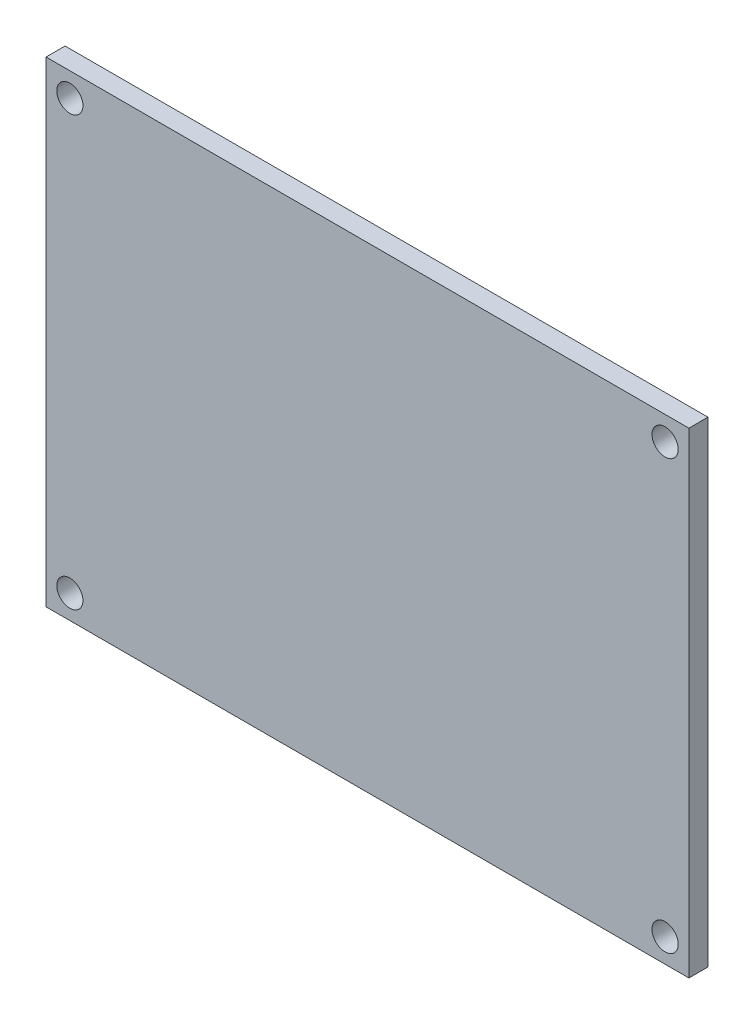
ISO-10303-21;
HEADER;
FILE_DESCRIPTION(('STEP AP214'),'2;1');
FILE_NAME('part.step','',(''),(''),'','','');
FILE_SCHEMA(('AUTOMOTIVE_DESIGN { 1 0 10303 214 1 1 1 1 }'));
ENDSEC;
DATA;
#1=APPLICATION_CONTEXT('core data for automotive mechanical design processes');
#2=APPLICATION_PROTOCOL_DEFINITION('international standard','automotive_design',2000,#1);
#3=PRODUCT_CONTEXT('',#1,'mechanical');
#4=PRODUCT('Part','Part','',(#3));
#5=PRODUCT_RELATED_PRODUCT_CATEGORY('part','',(#4));
#6=PRODUCT_DEFINITION_FORMATION('','',#4);
#7=PRODUCT_DEFINITION_CONTEXT('part definition',#1,'design');
#8=PRODUCT_DEFINITION('design','',#6,#7);
#9=PRODUCT_DEFINITION_SHAPE('','',#8);
#10=(LENGTH_UNIT() NAMED_UNIT(*) SI_UNIT(.MILLI.,.METRE.));
#11=(NAMED_UNIT(*) PLANE_ANGLE_UNIT() SI_UNIT($,.RADIAN.));
#12=(NAMED_UNIT(*) SI_UNIT($,.STERADIAN.) SOLID_ANGLE_UNIT());
#13=UNCERTAINTY_MEASURE_WITH_UNIT(LENGTH_MEASURE(1.E-05),#10,'distance_accuracy_value','');
#14=(GEOMETRIC_REPRESENTATION_CONTEXT(3) GLOBAL_UNCERTAINTY_ASSIGNED_CONTEXT((#13)) GLOBAL_UNIT_ASSIGNED_CONTEXT((#10,
#11,#12)) REPRESENTATION_CONTEXT('',''));
#15=CARTESIAN_POINT('',(0.,0.,0.));
#16=DIRECTION('',(0.,0.,1.));
#17=DIRECTION('',(1.,0.,0.));
#18=AXIS2_PLACEMENT_3D('',#15,#16,#17);
#19=CARTESIAN_POINT('',(0.,0.,1.6));
#20=DIRECTION('',(0.,0.,1.));
#21=DIRECTION('',(1.,0.,0.));
#22=AXIS2_PLACEMENT_3D('',#19,#20,#21);
#23=PLANE('',#22);
#24=CARTESIAN_POINT('',(52.,38.,1.6));
#25=DIRECTION('',(0.,0.,1.));
#26=DIRECTION('',(1.,0.,0.));
#27=AXIS2_PLACEMENT_3D('',#24,#25,#26);
#28=CIRCLE('',#27,1.1);
#29=CARTESIAN_POINT('',(53.1,38.,1.6));
#30=VERTEX_POINT('',#29);
#31=EDGE_CURVE('E121',#30,#30,#28,.T.);
#32=ORIENTED_EDGE('',*,*,#31,.F.);
#33=EDGE_LOOP('',(#32));
#34=FACE_BOUND('',#33,.T.);
#35=CARTESIAN_POINT('',(2.,2.,1.6));
#36=DIRECTION('',(0.,0.,1.));
#37=DIRECTION('',(1.,0.,0.));
#38=AXIS2_PLACEMENT_3D('',#35,#36,#37);
#39=CIRCLE('',#38,1.1);
#40=CARTESIAN_POINT('',(3.1,2.,1.6));
#41=VERTEX_POINT('',#40);
#42=EDGE_CURVE('E100',#41,#41,#39,.T.);
#43=ORIENTED_EDGE('',*,*,#42,.F.);
#44=EDGE_LOOP('',(#43));
#45=FACE_BOUND('',#44,.T.);
#46=DIRECTION('',(0.,-1.,0.));
#47=VECTOR('',#46,1.);
#48=CARTESIAN_POINT('',(0.,40.,1.6));
#49=LINE('',#48,#47);
#50=CARTESIAN_POINT('',(0.,40.,1.6));
#51=VERTEX_POINT('',#50);
#52=CARTESIAN_POINT('',(0.,0.,1.6));
#53=VERTEX_POINT('',#52);
#54=EDGE_CURVE('E85',#51,#53,#49,.T.);
#55=ORIENTED_EDGE('',*,*,#54,.T.);
#56=DIRECTION('',(1.,0.,0.));
#57=VECTOR('',#56,1.);
#58=CARTESIAN_POINT('',(0.,0.,1.6));
#59=LINE('',#58,#57);
#60=CARTESIAN_POINT('',(54.,0.,1.6));
#61=VERTEX_POINT('',#60);
#62=EDGE_CURVE('E80',#53,#61,#59,.T.);
#63=ORIENTED_EDGE('',*,*,#62,.T.);
#64=DIRECTION('',(0.,1.,0.));
#65=VECTOR('',#64,1.);
#66=CARTESIAN_POINT('',(54.,0.,1.6));
#67=LINE('',#66,#65);
#68=CARTESIAN_POINT('',(54.,40.,1.6));
#69=VERTEX_POINT('',#68);
#70=EDGE_CURVE('E83',#61,#69,#67,.T.);
#71=ORIENTED_EDGE('',*,*,#70,.T.);
#72=DIRECTION('',(-1.,0.,0.));
#73=VECTOR('',#72,1.);
#74=CARTESIAN_POINT('',(54.,40.,1.6));
#75=LINE('',#74,#73);
#76=EDGE_CURVE('E50',#69,#51,#75,.T.);
#77=ORIENTED_EDGE('',*,*,#76,.T.);
#78=EDGE_LOOP('',(#55,#63,#71,#77));
#79=FACE_BOUND('',#78,.T.);
#80=CARTESIAN_POINT('',(52.,2.,1.6));
#81=DIRECTION('',(0.,0.,1.));
#82=DIRECTION('',(1.,0.,0.));
#83=AXIS2_PLACEMENT_3D('',#80,#81,#82);
#84=CIRCLE('',#83,1.1);
#85=CARTESIAN_POINT('',(53.1,2.,1.6));
#86=VERTEX_POINT('',#85);
#87=EDGE_CURVE('E115',#86,#86,#84,.T.);
#88=ORIENTED_EDGE('',*,*,#87,.F.);
#89=EDGE_LOOP('',(#88));
#90=FACE_BOUND('',#89,.T.);
#91=CARTESIAN_POINT('',(2.,38.,1.6));
#92=DIRECTION('',(0.,0.,1.));
#93=DIRECTION('',(1.,0.,0.));
#94=AXIS2_PLACEMENT_3D('',#91,#92,#93);
#95=CIRCLE('',#94,1.1);
#96=CARTESIAN_POINT('',(3.1,38.,1.6));
#97=VERTEX_POINT('',#96);
#98=EDGE_CURVE('E127',#97,#97,#95,.T.);
#99=ORIENTED_EDGE('',*,*,#98,.F.);
#100=EDGE_LOOP('',(#99));
#101=FACE_BOUND('',#100,.T.);
#102=ADVANCED_FACE('F33',(#34,#45,#79,#90,#101),#23,.T.);
#103=CARTESIAN_POINT('',(0.,0.,0.));
#104=DIRECTION('',(0.,0.,1.));
#105=DIRECTION('',(1.,0.,0.));
#106=AXIS2_PLACEMENT_3D('',#103,#104,#105);
#107=PLANE('',#106);
#108=DIRECTION('',(0.,-1.,0.));
#109=VECTOR('',#108,1.);
#110=CARTESIAN_POINT('',(0.,40.,0.));
#111=LINE('',#110,#109);
#112=CARTESIAN_POINT('',(0.,40.,0.));
#113=VERTEX_POINT('',#112);
#114=CARTESIAN_POINT('',(0.,0.,0.));
#115=VERTEX_POINT('',#114);
#116=EDGE_CURVE('E97',#113,#115,#111,.T.);
#117=ORIENTED_EDGE('',*,*,#116,.F.);
#118=DIRECTION('',(-1.,0.,0.));
#119=VECTOR('',#118,1.);
#120=CARTESIAN_POINT('',(54.,40.,0.));
#121=LINE('',#120,#119);
#122=CARTESIAN_POINT('',(54.,40.,0.));
#123=VERTEX_POINT('',#122);
#124=EDGE_CURVE('E73',#123,#113,#121,.T.);
#125=ORIENTED_EDGE('',*,*,#124,.F.);
#126=DIRECTION('',(0.,1.,0.));
#127=VECTOR('',#126,1.);
#128=CARTESIAN_POINT('',(54.,0.,0.));
#129=LINE('',#128,#127);
#130=CARTESIAN_POINT('',(54.,0.,0.));
#131=VERTEX_POINT('',#130);
#132=EDGE_CURVE('E67',#131,#123,#129,.T.);
#133=ORIENTED_EDGE('',*,*,#132,.F.);
#134=DIRECTION('',(1.,0.,0.));
#135=VECTOR('',#134,1.);
#136=CARTESIAN_POINT('',(0.,0.,0.));
#137=LINE('',#136,#135);
#138=EDGE_CURVE('E89',#115,#131,#137,.T.);
#139=ORIENTED_EDGE('',*,*,#138,.F.);
#140=EDGE_LOOP('',(#117,#125,#133,#139));
#141=FACE_BOUND('',#140,.T.);
#142=CARTESIAN_POINT('',(2.,2.,0.));
#143=DIRECTION('',(0.,0.,1.));
#144=DIRECTION('',(1.,0.,0.));
#145=AXIS2_PLACEMENT_3D('',#142,#143,#144);
#146=CIRCLE('',#145,1.1);
#147=CARTESIAN_POINT('',(3.1,2.,0.));
#148=VERTEX_POINT('',#147);
#149=EDGE_CURVE('E112',#148,#148,#146,.T.);
#150=ORIENTED_EDGE('',*,*,#149,.T.);
#151=EDGE_LOOP('',(#150));
#152=FACE_BOUND('',#151,.T.);
#153=CARTESIAN_POINT('',(52.,2.,0.));
#154=DIRECTION('',(0.,0.,1.));
#155=DIRECTION('',(1.,0.,0.));
#156=AXIS2_PLACEMENT_3D('',#153,#154,#155);
#157=CIRCLE('',#156,1.1);
#158=CARTESIAN_POINT('',(53.1,2.,0.));
#159=VERTEX_POINT('',#158);
#160=EDGE_CURVE('E118',#159,#159,#157,.T.);
#161=ORIENTED_EDGE('',*,*,#160,.T.);
#162=EDGE_LOOP('',(#161));
#163=FACE_BOUND('',#162,.T.);
#164=CARTESIAN_POINT('',(52.,38.,0.));
#165=DIRECTION('',(0.,0.,1.));
#166=DIRECTION('',(1.,0.,0.));
#167=AXIS2_PLACEMENT_3D('',#164,#165,#166);
#168=CIRCLE('',#167,1.1);
#169=CARTESIAN_POINT('',(53.1,38.,0.));
#170=VERTEX_POINT('',#169);
#171=EDGE_CURVE('E124',#170,#170,#168,.T.);
#172=ORIENTED_EDGE('',*,*,#171,.T.);
#173=EDGE_LOOP('',(#172));
#174=FACE_BOUND('',#173,.T.);
#175=CARTESIAN_POINT('',(2.,38.,0.));
#176=DIRECTION('',(0.,0.,1.));
#177=DIRECTION('',(1.,0.,0.));
#178=AXIS2_PLACEMENT_3D('',#175,#176,#177);
#179=CIRCLE('',#178,1.1);
#180=CARTESIAN_POINT('',(3.1,38.,0.));
#181=VERTEX_POINT('',#180);
#182=EDGE_CURVE('E130',#181,#181,#179,.T.);
#183=ORIENTED_EDGE('',*,*,#182,.T.);
#184=EDGE_LOOP('',(#183));
#185=FACE_BOUND('',#184,.T.);
#186=ADVANCED_FACE('F108',(#141,#152,#163,#174,#185),#107,.F.);
#187=CARTESIAN_POINT('',(0.,40.,1.6));
#188=DIRECTION('',(1.,0.,0.));
#189=DIRECTION('',(0.,0.,-1.));
#190=AXIS2_PLACEMENT_3D('',#187,#188,#189);
#191=PLANE('',#190);
#192=ORIENTED_EDGE('',*,*,#116,.T.);
#193=DIRECTION('',(0.,0.,-1.));
#194=VECTOR('',#193,1.);
#195=CARTESIAN_POINT('',(0.,0.,1.6));
#196=LINE('',#195,#194);
#197=EDGE_CURVE('E11',#53,#115,#196,.T.);
#198=ORIENTED_EDGE('',*,*,#197,.F.);
#199=ORIENTED_EDGE('',*,*,#54,.F.);
#200=DIRECTION('',(0.,0.,-1.));
#201=VECTOR('',#200,1.);
#202=CARTESIAN_POINT('',(0.,40.,1.6));
#203=LINE('',#202,#201);
#204=EDGE_CURVE('E93',#51,#113,#203,.T.);
#205=ORIENTED_EDGE('',*,*,#204,.T.);
#206=EDGE_LOOP('',(#192,#198,#199,#205));
#207=FACE_BOUND('',#206,.T.);
#208=ADVANCED_FACE('F35',(#207),#191,.F.);
#209=CARTESIAN_POINT('',(0.,0.,1.6));
#210=DIRECTION('',(0.,1.,0.));
#211=DIRECTION('',(0.,0.,1.));
#212=AXIS2_PLACEMENT_3D('',#209,#210,#211);
#213=PLANE('',#212);
#214=ORIENTED_EDGE('',*,*,#138,.T.);
#215=DIRECTION('',(0.,0.,-1.));
#216=VECTOR('',#215,1.);
#217=CARTESIAN_POINT('',(54.,0.,1.6));
#218=LINE('',#217,#216);
#219=EDGE_CURVE('E42',#61,#131,#218,.T.);
#220=ORIENTED_EDGE('',*,*,#219,.F.);
#221=ORIENTED_EDGE('',*,*,#62,.F.);
#222=ORIENTED_EDGE('',*,*,#197,.T.);
#223=EDGE_LOOP('',(#214,#220,#221,#222));
#224=FACE_BOUND('',#223,.T.);
#225=ADVANCED_FACE('F88',(#224),#213,.F.);
#226=CARTESIAN_POINT('',(54.,0.,1.6));
#227=DIRECTION('',(-1.,0.,0.));
#228=DIRECTION('',(0.,0.,1.));
#229=AXIS2_PLACEMENT_3D('',#226,#227,#228);
#230=PLANE('',#229);
#231=ORIENTED_EDGE('',*,*,#132,.T.);
#232=DIRECTION('',(0.,0.,-1.));
#233=VECTOR('',#232,1.);
#234=CARTESIAN_POINT('',(54.,40.,1.6));
#235=LINE('',#234,#233);
#236=EDGE_CURVE('E90',#69,#123,#235,.T.);
#237=ORIENTED_EDGE('',*,*,#236,.F.);
#238=ORIENTED_EDGE('',*,*,#70,.F.);
#239=ORIENTED_EDGE('',*,*,#219,.T.);
#240=EDGE_LOOP('',(#231,#237,#238,#239));
#241=FACE_BOUND('',#240,.T.);
#242=ADVANCED_FACE('F91',(#241),#230,.F.);
#243=CARTESIAN_POINT('',(54.,40.,1.6));
#244=DIRECTION('',(0.,-1.,0.));
#245=DIRECTION('',(0.,0.,-1.));
#246=AXIS2_PLACEMENT_3D('',#243,#244,#245);
#247=PLANE('',#246);
#248=ORIENTED_EDGE('',*,*,#124,.T.);
#249=ORIENTED_EDGE('',*,*,#204,.F.);
#250=ORIENTED_EDGE('',*,*,#76,.F.);
#251=ORIENTED_EDGE('',*,*,#236,.T.);
#252=EDGE_LOOP('',(#248,#249,#250,#251));
#253=FACE_BOUND('',#252,.T.);
#254=ADVANCED_FACE('F105',(#253),#247,.F.);
#255=CARTESIAN_POINT('',(2.,2.,1.6));
#256=DIRECTION('',(0.,0.,-1.));
#257=DIRECTION('',(-1.,0.,0.));
#258=AXIS2_PLACEMENT_3D('',#255,#256,#257);
#259=CYLINDRICAL_SURFACE('',#258,1.1);
#260=ORIENTED_EDGE('',*,*,#42,.T.);
#261=EDGE_LOOP('',(#260));
#262=FACE_BOUND('',#261,.T.);
#263=ORIENTED_EDGE('',*,*,#149,.F.);
#264=EDGE_LOOP('',(#263));
#265=FACE_BOUND('',#264,.T.);
#266=ADVANCED_FACE('F149',(#262,#265),#259,.F.);
#267=CARTESIAN_POINT('',(52.,2.,1.6));
#268=DIRECTION('',(0.,0.,-1.));
#269=DIRECTION('',(-1.,0.,0.));
#270=AXIS2_PLACEMENT_3D('',#267,#268,#269);
#271=CYLINDRICAL_SURFACE('',#270,1.1);
#272=ORIENTED_EDGE('',*,*,#87,.T.);
#273=EDGE_LOOP('',(#272));
#274=FACE_BOUND('',#273,.T.);
#275=ORIENTED_EDGE('',*,*,#160,.F.);
#276=EDGE_LOOP('',(#275));
#277=FACE_BOUND('',#276,.T.);
#278=ADVANCED_FACE('F195',(#274,#277),#271,.F.);
#279=CARTESIAN_POINT('',(52.,38.,1.6));
#280=DIRECTION('',(0.,0.,-1.));
#281=DIRECTION('',(-1.,0.,0.));
#282=AXIS2_PLACEMENT_3D('',#279,#280,#281);
#283=CYLINDRICAL_SURFACE('',#282,1.1);
#284=ORIENTED_EDGE('',*,*,#31,.T.);
#285=EDGE_LOOP('',(#284));
#286=FACE_BOUND('',#285,.T.);
#287=ORIENTED_EDGE('',*,*,#171,.F.);
#288=EDGE_LOOP('',(#287));
#289=FACE_BOUND('',#288,.T.);
#290=ADVANCED_FACE('F203',(#286,#289),#283,.F.);
#291=CARTESIAN_POINT('',(2.,38.,1.6));
#292=DIRECTION('',(0.,0.,-1.));
#293=DIRECTION('',(-1.,0.,0.));
#294=AXIS2_PLACEMENT_3D('',#291,#292,#293);
#295=CYLINDRICAL_SURFACE('',#294,1.1);
#296=ORIENTED_EDGE('',*,*,#98,.T.);
#297=EDGE_LOOP('',(#296));
#298=FACE_BOUND('',#297,.T.);
#299=ORIENTED_EDGE('',*,*,#182,.F.);
#300=EDGE_LOOP('',(#299));
#301=FACE_BOUND('',#300,.T.);
#302=ADVANCED_FACE('F136',(#298,#301),#295,.F.);
#303=CLOSED_SHELL('',(#102,#186,#208,#225,#242,#254,#266,#278,#290,#302));
#304=MANIFOLD_SOLID_BREP('B2',#303);
#305=ADVANCED_BREP_SHAPE_REPRESENTATION('',(#18,#304),#14);
#306=SHAPE_DEFINITION_REPRESENTATION(#9,#305);
ENDSEC;
END-ISO-10303-21;
